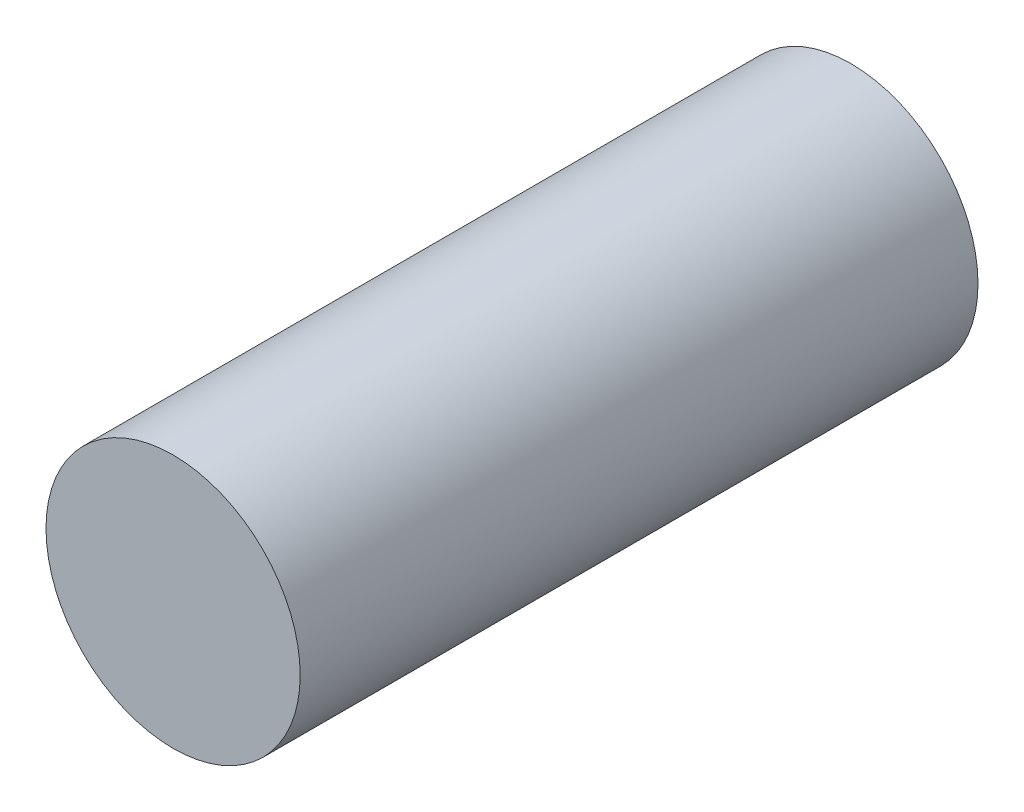
ISO-10303-21;
HEADER;
FILE_DESCRIPTION(('STEP AP214'),'2;1');
FILE_NAME('part.step','',(''),(''),'','','');
FILE_SCHEMA(('AUTOMOTIVE_DESIGN { 1 0 10303 214 1 1 1 1 }'));
ENDSEC;
DATA;
#1=APPLICATION_CONTEXT('core data for automotive mechanical design processes');
#2=APPLICATION_PROTOCOL_DEFINITION('international standard','automotive_design',2000,#1);
#3=PRODUCT_CONTEXT('',#1,'mechanical');
#4=PRODUCT('Part','Part','',(#3));
#5=PRODUCT_RELATED_PRODUCT_CATEGORY('part','',(#4));
#6=PRODUCT_DEFINITION_FORMATION('','',#4);
#7=PRODUCT_DEFINITION_CONTEXT('part definition',#1,'design');
#8=PRODUCT_DEFINITION('design','',#6,#7);
#9=PRODUCT_DEFINITION_SHAPE('','',#8);
#10=(LENGTH_UNIT() NAMED_UNIT(*) SI_UNIT(.MILLI.,.METRE.));
#11=(NAMED_UNIT(*) PLANE_ANGLE_UNIT() SI_UNIT($,.RADIAN.));
#12=(NAMED_UNIT(*) SI_UNIT($,.STERADIAN.) SOLID_ANGLE_UNIT());
#13=UNCERTAINTY_MEASURE_WITH_UNIT(LENGTH_MEASURE(1.E-05),#10,'distance_accuracy_value','');
#14=(GEOMETRIC_REPRESENTATION_CONTEXT(3) GLOBAL_UNCERTAINTY_ASSIGNED_CONTEXT((#13)) GLOBAL_UNIT_ASSIGNED_CONTEXT((#10,
#11,#12)) REPRESENTATION_CONTEXT('',''));
#15=CARTESIAN_POINT('',(0.,0.,0.));
#16=DIRECTION('',(0.,0.,1.));
#17=DIRECTION('',(1.,0.,0.));
#18=AXIS2_PLACEMENT_3D('',#15,#16,#17);
#19=CARTESIAN_POINT('',(0.,0.,56.));
#20=DIRECTION('',(0.,0.,-1.));
#21=DIRECTION('',(-1.,0.,0.));
#22=AXIS2_PLACEMENT_3D('',#19,#20,#21);
#23=CYLINDRICAL_SURFACE('',#22,10.5);
#24=CARTESIAN_POINT('',(0.,0.,56.));
#25=DIRECTION('',(0.,0.,1.));
#26=DIRECTION('',(1.,0.,0.));
#27=AXIS2_PLACEMENT_3D('',#24,#25,#26);
#28=CIRCLE('',#27,10.5);
#29=CARTESIAN_POINT('',(10.5,0.,56.));
#30=VERTEX_POINT('',#29);
#31=EDGE_CURVE('E10',#30,#30,#28,.T.);
#32=ORIENTED_EDGE('',*,*,#31,.F.);
#33=EDGE_LOOP('',(#32));
#34=FACE_BOUND('',#33,.T.);
#35=CARTESIAN_POINT('',(0.,0.,0.));
#36=DIRECTION('',(0.,0.,1.));
#37=DIRECTION('',(1.,0.,0.));
#38=AXIS2_PLACEMENT_3D('',#35,#36,#37);
#39=CIRCLE('',#38,10.5);
#40=CARTESIAN_POINT('',(10.5,0.,0.));
#41=VERTEX_POINT('',#40);
#42=EDGE_CURVE('E42',#41,#41,#39,.T.);
#43=ORIENTED_EDGE('',*,*,#42,.T.);
#44=EDGE_LOOP('',(#43));
#45=FACE_BOUND('',#44,.T.);
#46=ADVANCED_FACE('F39',(#34,#45),#23,.T.);
#47=CARTESIAN_POINT('',(0.,0.,56.));
#48=DIRECTION('',(0.,0.,1.));
#49=DIRECTION('',(1.,0.,0.));
#50=AXIS2_PLACEMENT_3D('',#47,#48,#49);
#51=PLANE('',#50);
#52=ORIENTED_EDGE('',*,*,#31,.T.);
#53=EDGE_LOOP('',(#52));
#54=FACE_BOUND('',#53,.T.);
#55=ADVANCED_FACE('F56',(#54),#51,.T.);
#56=CARTESIAN_POINT('',(0.,0.,0.));
#57=DIRECTION('',(0.,0.,1.));
#58=DIRECTION('',(1.,0.,0.));
#59=AXIS2_PLACEMENT_3D('',#56,#57,#58);
#60=PLANE('',#59);
#61=ORIENTED_EDGE('',*,*,#42,.F.);
#62=EDGE_LOOP('',(#61));
#63=FACE_BOUND('',#62,.T.);
#64=ADVANCED_FACE('F54',(#63),#60,.F.);
#65=CLOSED_SHELL('',(#46,#55,#64));
#66=MANIFOLD_SOLID_BREP('B2',#65);
#67=ADVANCED_BREP_SHAPE_REPRESENTATION('',(#18,#66),#14);
#68=SHAPE_DEFINITION_REPRESENTATION(#9,#67);
ENDSEC;
END-ISO-10303-21;
